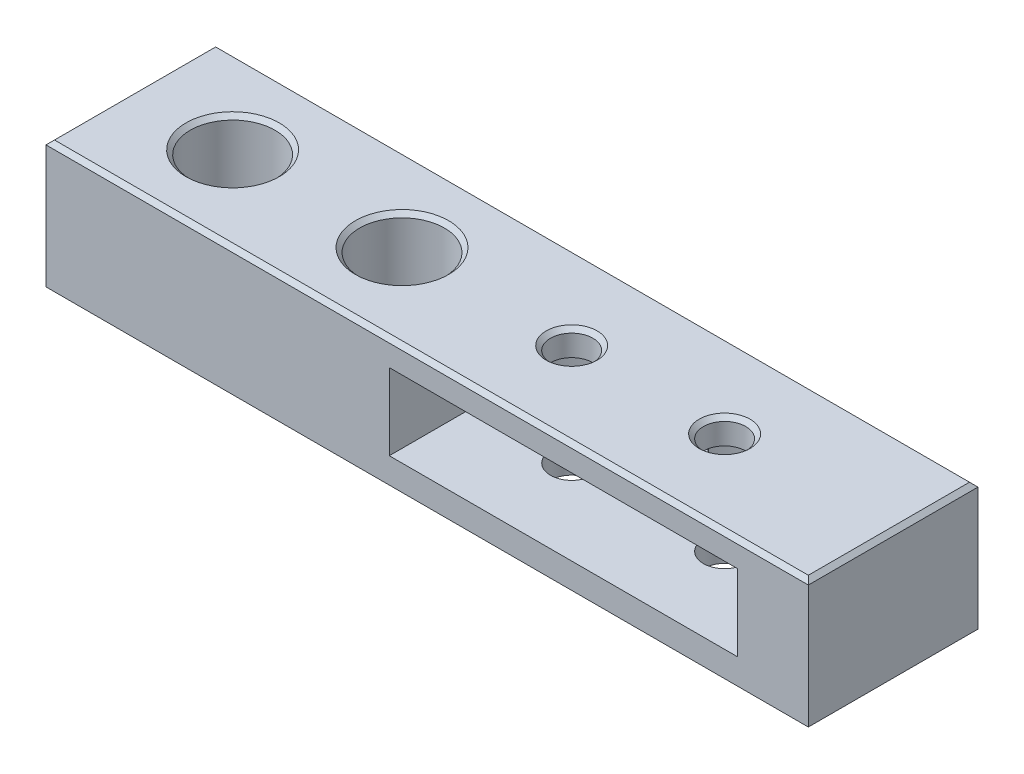
ISO-10303-21;
HEADER;
FILE_DESCRIPTION(('STEP AP214'),'2;1');
FILE_NAME('part.step','',(''),(''),'','','');
FILE_SCHEMA(('AUTOMOTIVE_DESIGN { 1 0 10303 214 1 1 1 1 }'));
ENDSEC;
DATA;
#1=APPLICATION_CONTEXT('core data for automotive mechanical design processes');
#2=APPLICATION_PROTOCOL_DEFINITION('international standard','automotive_design',2000,#1);
#3=PRODUCT_CONTEXT('',#1,'mechanical');
#4=PRODUCT('Part','Part','',(#3));
#5=PRODUCT_RELATED_PRODUCT_CATEGORY('part','',(#4));
#6=PRODUCT_DEFINITION_FORMATION('','',#4);
#7=PRODUCT_DEFINITION_CONTEXT('part definition',#1,'design');
#8=PRODUCT_DEFINITION('design','',#6,#7);
#9=PRODUCT_DEFINITION_SHAPE('','',#8);
#10=(LENGTH_UNIT() NAMED_UNIT(*) SI_UNIT(.MILLI.,.METRE.));
#11=(NAMED_UNIT(*) PLANE_ANGLE_UNIT() SI_UNIT($,.RADIAN.));
#12=(NAMED_UNIT(*) SI_UNIT($,.STERADIAN.) SOLID_ANGLE_UNIT());
#13=UNCERTAINTY_MEASURE_WITH_UNIT(LENGTH_MEASURE(1.E-05),#10,'distance_accuracy_value','');
#14=(GEOMETRIC_REPRESENTATION_CONTEXT(3) GLOBAL_UNCERTAINTY_ASSIGNED_CONTEXT((#13)) GLOBAL_UNIT_ASSIGNED_CONTEXT((#10,
#11,#12)) REPRESENTATION_CONTEXT('',''));
#15=CARTESIAN_POINT('',(0.,0.,0.));
#16=DIRECTION('',(0.,0.,1.));
#17=DIRECTION('',(1.,0.,0.));
#18=AXIS2_PLACEMENT_3D('',#15,#16,#17);
#19=CARTESIAN_POINT('',(0.,0.,0.));
#20=DIRECTION('',(0.,1.,0.));
#21=DIRECTION('',(0.,0.,1.));
#22=AXIS2_PLACEMENT_3D('',#19,#20,#21);
#23=PLANE('',#22);
#24=DIRECTION('',(0.,0.,-1.));
#25=VECTOR('',#24,1.);
#26=CARTESIAN_POINT('',(-14.,0.,-3.05));
#27=LINE('',#26,#25);
#28=CARTESIAN_POINT('',(-14.,0.,3.05));
#29=VERTEX_POINT('',#28);
#30=CARTESIAN_POINT('',(-14.,0.,-3.05));
#31=VERTEX_POINT('',#30);
#32=EDGE_CURVE('E217',#29,#31,#27,.T.);
#33=ORIENTED_EDGE('',*,*,#32,.F.);
#34=DIRECTION('',(-1.,0.,0.));
#35=VECTOR('',#34,1.);
#36=CARTESIAN_POINT('',(-9.,0.,3.05));
#37=LINE('',#36,#35);
#38=CARTESIAN_POINT('',(-9.,0.,3.05));
#39=VERTEX_POINT('',#38);
#40=EDGE_CURVE('E230',#39,#29,#37,.T.);
#41=ORIENTED_EDGE('',*,*,#40,.F.);
#42=DIRECTION('',(0.,0.,1.));
#43=VECTOR('',#42,1.);
#44=CARTESIAN_POINT('',(-9.,0.,-3.05));
#45=LINE('',#44,#43);
#46=CARTESIAN_POINT('',(-9.,0.,-3.05));
#47=VERTEX_POINT('',#46);
#48=EDGE_CURVE('E239',#47,#39,#45,.T.);
#49=ORIENTED_EDGE('',*,*,#48,.F.);
#50=DIRECTION('',(1.,0.,0.));
#51=VECTOR('',#50,1.);
#52=CARTESIAN_POINT('',(-9.,0.,-3.05));
#53=LINE('',#52,#51);
#54=EDGE_CURVE('E220',#31,#47,#53,.T.);
#55=ORIENTED_EDGE('',*,*,#54,.F.);
#56=EDGE_LOOP('',(#33,#41,#49,#55));
#57=FACE_BOUND('',#56,.T.);
#58=CARTESIAN_POINT('',(-58.,0.,0.));
#59=DIRECTION('',(0.,1.,0.));
#60=DIRECTION('',(0.,0.,1.));
#61=AXIS2_PLACEMENT_3D('',#58,#59,#60);
#62=CIRCLE('',#61,2.75);
#63=CARTESIAN_POINT('',(-58.,0.,2.75));
#64=VERTEX_POINT('',#63);
#65=EDGE_CURVE('E330',#64,#64,#62,.T.);
#66=ORIENTED_EDGE('',*,*,#65,.T.);
#67=EDGE_LOOP('',(#66));
#68=FACE_BOUND('',#67,.T.);
#69=CARTESIAN_POINT('',(-38.03,0.,0.));
#70=DIRECTION('',(0.,1.,0.));
#71=DIRECTION('',(0.,0.,1.));
#72=AXIS2_PLACEMENT_3D('',#69,#70,#71);
#73=CIRCLE('',#72,2.75);
#74=CARTESIAN_POINT('',(-38.03,0.,2.75));
#75=VERTEX_POINT('',#74);
#76=EDGE_CURVE('E339',#75,#75,#73,.T.);
#77=ORIENTED_EDGE('',*,*,#76,.T.);
#78=EDGE_LOOP('',(#77));
#79=FACE_BOUND('',#78,.T.);
#80=CARTESIAN_POINT('',(0.,0.,0.));
#81=DIRECTION('',(0.,1.,0.));
#82=DIRECTION('',(0.,0.,1.));
#83=AXIS2_PLACEMENT_3D('',#80,#81,#82);
#84=CIRCLE('',#83,2.5);
#85=CARTESIAN_POINT('',(0.,0.,2.5));
#86=VERTEX_POINT('',#85);
#87=EDGE_CURVE('E345',#86,#86,#84,.T.);
#88=ORIENTED_EDGE('',*,*,#87,.T.);
#89=EDGE_LOOP('',(#88));
#90=FACE_BOUND('',#89,.T.);
#91=CARTESIAN_POINT('',(-18.03,0.,0.));
#92=DIRECTION('',(0.,1.,0.));
#93=DIRECTION('',(0.,0.,1.));
#94=AXIS2_PLACEMENT_3D('',#91,#92,#93);
#95=CIRCLE('',#94,2.5);
#96=CARTESIAN_POINT('',(-18.03,0.,2.5));
#97=VERTEX_POINT('',#96);
#98=EDGE_CURVE('E342',#97,#97,#95,.T.);
#99=ORIENTED_EDGE('',*,*,#98,.T.);
#100=EDGE_LOOP('',(#99));
#101=FACE_BOUND('',#100,.T.);
#102=DIRECTION('',(1.,0.,0.));
#103=VECTOR('',#102,1.);
#104=CARTESIAN_POINT('',(-65.,0.,-3.05));
#105=LINE('',#104,#103);
#106=CARTESIAN_POINT('',(-70.,0.,-3.05));
#107=VERTEX_POINT('',#106);
#108=CARTESIAN_POINT('',(-65.,0.,-3.05));
#109=VERTEX_POINT('',#108);
#110=EDGE_CURVE('E422',#107,#109,#105,.T.);
#111=ORIENTED_EDGE('',*,*,#110,.F.);
#112=DIRECTION('',(0.,0.,1.));
#113=VECTOR('',#112,1.);
#114=CARTESIAN_POINT('',(-70.,0.,-9.99999999999999));
#115=LINE('',#114,#113);
#116=CARTESIAN_POINT('',(-70.,0.,-9.99999999999999));
#117=VERTEX_POINT('',#116);
#118=EDGE_CURVE('E216',#117,#107,#115,.T.);
#119=ORIENTED_EDGE('',*,*,#118,.F.);
#120=DIRECTION('',(-1.,0.,0.));
#121=VECTOR('',#120,1.);
#122=CARTESIAN_POINT('',(-70.,0.,-9.99999999999999));
#123=LINE('',#122,#121);
#124=CARTESIAN_POINT('',(19.87,0.,-10.));
#125=VERTEX_POINT('',#124);
#126=EDGE_CURVE('E348',#125,#117,#123,.T.);
#127=ORIENTED_EDGE('',*,*,#126,.F.);
#128=DIRECTION('',(0.,0.,-1.));
#129=VECTOR('',#128,1.);
#130=CARTESIAN_POINT('',(19.87,0.,10.));
#131=LINE('',#130,#129);
#132=CARTESIAN_POINT('',(19.87,0.,10.));
#133=VERTEX_POINT('',#132);
#134=EDGE_CURVE('E319',#133,#125,#131,.T.);
#135=ORIENTED_EDGE('',*,*,#134,.F.);
#136=DIRECTION('',(1.,0.,0.));
#137=VECTOR('',#136,1.);
#138=CARTESIAN_POINT('',(-70.,0.,10.));
#139=LINE('',#138,#137);
#140=CARTESIAN_POINT('',(-70.,0.,10.));
#141=VERTEX_POINT('',#140);
#142=EDGE_CURVE('E353',#141,#133,#139,.T.);
#143=ORIENTED_EDGE('',*,*,#142,.F.);
#144=CARTESIAN_POINT('',(-70.,0.,3.05));
#145=VERTEX_POINT('',#144);
#146=EDGE_CURVE('E351',#145,#141,#115,.T.);
#147=ORIENTED_EDGE('',*,*,#146,.F.);
#148=DIRECTION('',(-1.,0.,0.));
#149=VECTOR('',#148,1.);
#150=CARTESIAN_POINT('',(-65.,0.,3.05));
#151=LINE('',#150,#149);
#152=CARTESIAN_POINT('',(-65.,0.,3.05));
#153=VERTEX_POINT('',#152);
#154=EDGE_CURVE('E210',#153,#145,#151,.T.);
#155=ORIENTED_EDGE('',*,*,#154,.F.);
#156=DIRECTION('',(0.,0.,1.));
#157=VECTOR('',#156,1.);
#158=CARTESIAN_POINT('',(-65.,0.,-3.05));
#159=LINE('',#158,#157);
#160=EDGE_CURVE('E426',#109,#153,#159,.T.);
#161=ORIENTED_EDGE('',*,*,#160,.F.);
#162=EDGE_LOOP('',(#111,#119,#127,#135,#143,#147,#155,#161));
#163=FACE_BOUND('',#162,.T.);
#164=ADVANCED_FACE('F33',(#57,#68,#79,#90,#101,#163),#23,.F.);
#165=CARTESIAN_POINT('',(0.,15.,0.));
#166=DIRECTION('',(0.,-1.,0.));
#167=DIRECTION('',(0.,0.,-1.));
#168=AXIS2_PLACEMENT_3D('',#165,#166,#167);
#169=CYLINDRICAL_SURFACE('',#168,2.5);
#170=CARTESIAN_POINT('',(0.,14.5,0.));
#171=DIRECTION('',(0.,1.,0.));
#172=DIRECTION('',(0.,0.,1.));
#173=AXIS2_PLACEMENT_3D('',#170,#171,#172);
#174=CIRCLE('',#173,2.5);
#175=CARTESIAN_POINT('',(0.,14.5,2.5));
#176=VERTEX_POINT('',#175);
#177=EDGE_CURVE('E407',#176,#176,#174,.T.);
#178=ORIENTED_EDGE('',*,*,#177,.T.);
#179=EDGE_LOOP('',(#178));
#180=FACE_BOUND('',#179,.T.);
#181=CARTESIAN_POINT('',(0.,12.,0.));
#182=DIRECTION('',(0.,-1.,0.));
#183=DIRECTION('',(0.,0.,-1.));
#184=AXIS2_PLACEMENT_3D('',#181,#182,#183);
#185=CIRCLE('',#184,2.5);
#186=CARTESIAN_POINT('',(0.,12.,-2.5));
#187=VERTEX_POINT('',#186);
#188=EDGE_CURVE('E303',#187,#187,#185,.T.);
#189=ORIENTED_EDGE('',*,*,#188,.T.);
#190=EDGE_LOOP('',(#189));
#191=FACE_BOUND('',#190,.T.);
#192=ADVANCED_FACE('F472',(#180,#191),#169,.F.);
#193=CARTESIAN_POINT('',(-18.03,15.,0.));
#194=DIRECTION('',(0.,-1.,0.));
#195=DIRECTION('',(0.,0.,-1.));
#196=AXIS2_PLACEMENT_3D('',#193,#194,#195);
#197=CYLINDRICAL_SURFACE('',#196,2.5);
#198=CARTESIAN_POINT('',(-18.03,14.5,0.));
#199=DIRECTION('',(0.,1.,0.));
#200=DIRECTION('',(0.,0.,1.));
#201=AXIS2_PLACEMENT_3D('',#198,#199,#200);
#202=CIRCLE('',#201,2.5);
#203=CARTESIAN_POINT('',(-18.03,14.5,2.5));
#204=VERTEX_POINT('',#203);
#205=EDGE_CURVE('E376',#204,#204,#202,.T.);
#206=ORIENTED_EDGE('',*,*,#205,.T.);
#207=EDGE_LOOP('',(#206));
#208=FACE_BOUND('',#207,.T.);
#209=CARTESIAN_POINT('',(-18.03,12.,0.));
#210=DIRECTION('',(0.,-1.,0.));
#211=DIRECTION('',(0.,0.,-1.));
#212=AXIS2_PLACEMENT_3D('',#209,#210,#211);
#213=CIRCLE('',#212,2.5);
#214=CARTESIAN_POINT('',(-18.03,12.,-2.5));
#215=VERTEX_POINT('',#214);
#216=EDGE_CURVE('E291',#215,#215,#213,.T.);
#217=ORIENTED_EDGE('',*,*,#216,.T.);
#218=EDGE_LOOP('',(#217));
#219=FACE_BOUND('',#218,.T.);
#220=ADVANCED_FACE('F478',(#208,#219),#197,.F.);
#221=CARTESIAN_POINT('',(0.,15.,0.));
#222=DIRECTION('',(0.,1.,0.));
#223=DIRECTION('',(0.,0.,1.));
#224=AXIS2_PLACEMENT_3D('',#221,#222,#223);
#225=PLANE('',#224);
#226=CARTESIAN_POINT('',(-18.03,15.,0.));
#227=DIRECTION('',(0.,1.,0.));
#228=DIRECTION('',(0.,0.,1.));
#229=AXIS2_PLACEMENT_3D('',#226,#227,#228);
#230=CIRCLE('',#229,2.99999999999999);
#231=CARTESIAN_POINT('',(-18.03,15.,2.99999999999999));
#232=VERTEX_POINT('',#231);
#233=EDGE_CURVE('E397',#232,#232,#230,.F.);
#234=ORIENTED_EDGE('',*,*,#233,.T.);
#235=EDGE_LOOP('',(#234));
#236=FACE_BOUND('',#235,.T.);
#237=DIRECTION('',(-1.,0.,0.));
#238=VECTOR('',#237,1.);
#239=CARTESIAN_POINT('',(-70.,15.,-9.5));
#240=LINE('',#239,#238);
#241=CARTESIAN_POINT('',(19.37,15.,-9.50000000000001));
#242=VERTEX_POINT('',#241);
#243=CARTESIAN_POINT('',(-69.5,15.,-9.5));
#244=VERTEX_POINT('',#243);
#245=EDGE_CURVE('E392',#242,#244,#240,.T.);
#246=ORIENTED_EDGE('',*,*,#245,.T.);
#247=DIRECTION('',(0.,0.,1.));
#248=VECTOR('',#247,1.);
#249=CARTESIAN_POINT('',(-69.5,15.,10.));
#250=LINE('',#249,#248);
#251=CARTESIAN_POINT('',(-69.5,15.,9.50000000000003));
#252=VERTEX_POINT('',#251);
#253=EDGE_CURVE('E394',#244,#252,#250,.T.);
#254=ORIENTED_EDGE('',*,*,#253,.T.);
#255=DIRECTION('',(1.,0.,0.));
#256=VECTOR('',#255,1.);
#257=CARTESIAN_POINT('',(19.87,15.,9.50000000000001));
#258=LINE('',#257,#256);
#259=CARTESIAN_POINT('',(19.37,15.,9.50000000000001));
#260=VERTEX_POINT('',#259);
#261=EDGE_CURVE('E388',#252,#260,#258,.T.);
#262=ORIENTED_EDGE('',*,*,#261,.T.);
#263=DIRECTION('',(0.,0.,-1.));
#264=VECTOR('',#263,1.);
#265=CARTESIAN_POINT('',(19.37,15.,0.));
#266=LINE('',#265,#264);
#267=EDGE_CURVE('E390',#260,#242,#266,.T.);
#268=ORIENTED_EDGE('',*,*,#267,.T.);
#269=EDGE_LOOP('',(#246,#254,#262,#268));
#270=FACE_BOUND('',#269,.T.);
#271=CARTESIAN_POINT('',(0.,15.,0.));
#272=DIRECTION('',(0.,1.,0.));
#273=DIRECTION('',(0.,0.,1.));
#274=AXIS2_PLACEMENT_3D('',#271,#272,#273);
#275=CIRCLE('',#274,2.99999999999999);
#276=CARTESIAN_POINT('',(0.,15.,2.99999999999999));
#277=VERTEX_POINT('',#276);
#278=EDGE_CURVE('E385',#277,#277,#275,.F.);
#279=ORIENTED_EDGE('',*,*,#278,.T.);
#280=EDGE_LOOP('',(#279));
#281=FACE_BOUND('',#280,.T.);
#282=CARTESIAN_POINT('',(-38.03,15.,0.));
#283=DIRECTION('',(0.,1.,0.));
#284=DIRECTION('',(0.,0.,1.));
#285=AXIS2_PLACEMENT_3D('',#282,#283,#284);
#286=CIRCLE('',#285,5.49999999999998);
#287=CARTESIAN_POINT('',(-38.03,15.,5.49999999999998));
#288=VERTEX_POINT('',#287);
#289=EDGE_CURVE('E382',#288,#288,#286,.F.);
#290=ORIENTED_EDGE('',*,*,#289,.T.);
#291=EDGE_LOOP('',(#290));
#292=FACE_BOUND('',#291,.T.);
#293=CARTESIAN_POINT('',(-58.,15.,0.));
#294=DIRECTION('',(0.,1.,0.));
#295=DIRECTION('',(0.,0.,1.));
#296=AXIS2_PLACEMENT_3D('',#293,#294,#295);
#297=CIRCLE('',#296,5.49999999999998);
#298=CARTESIAN_POINT('',(-58.,15.,5.49999999999998));
#299=VERTEX_POINT('',#298);
#300=EDGE_CURVE('E379',#299,#299,#297,.F.);
#301=ORIENTED_EDGE('',*,*,#300,.T.);
#302=EDGE_LOOP('',(#301));
#303=FACE_BOUND('',#302,.T.);
#304=ADVANCED_FACE('F457',(#236,#270,#281,#292,#303),#225,.T.);
#305=CARTESIAN_POINT('',(-70.,15.,-9.99999999999999));
#306=DIRECTION('',(0.,0.,1.));
#307=DIRECTION('',(1.,0.,0.));
#308=AXIS2_PLACEMENT_3D('',#305,#306,#307);
#309=PLANE('',#308);
#310=DIRECTION('',(0.,1.,0.));
#311=VECTOR('',#310,1.);
#312=CARTESIAN_POINT('',(-23.7089083458003,3.,-9.99999999999999));
#313=LINE('',#312,#311);
#314=CARTESIAN_POINT('',(-23.7089083458003,12.,-9.99999999999999));
#315=VERTEX_POINT('',#314);
#316=CARTESIAN_POINT('',(-23.7089083458003,3.,-9.99999999999999));
#317=VERTEX_POINT('',#316);
#318=EDGE_CURVE('E370',#315,#317,#313,.F.);
#319=ORIENTED_EDGE('',*,*,#318,.T.);
#320=DIRECTION('',(1.,0.,0.));
#321=VECTOR('',#320,1.);
#322=CARTESIAN_POINT('',(-70.,3.,-9.99999999999999));
#323=LINE('',#322,#321);
#324=CARTESIAN_POINT('',(-12.3510916541997,3.,-9.99999999999999));
#325=VERTEX_POINT('',#324);
#326=EDGE_CURVE('E316',#317,#325,#323,.T.);
#327=ORIENTED_EDGE('',*,*,#326,.T.);
#328=DIRECTION('',(0.,1.,0.));
#329=VECTOR('',#328,1.);
#330=CARTESIAN_POINT('',(-12.3510916541997,3.,-9.99999999999999));
#331=LINE('',#330,#329);
#332=CARTESIAN_POINT('',(-12.3510916541997,12.,-9.99999999999999));
#333=VERTEX_POINT('',#332);
#334=EDGE_CURVE('E373',#325,#333,#331,.T.);
#335=ORIENTED_EDGE('',*,*,#334,.T.);
#336=DIRECTION('',(1.,0.,0.));
#337=VECTOR('',#336,1.);
#338=CARTESIAN_POINT('',(-70.,12.,-9.99999999999999));
#339=LINE('',#338,#337);
#340=EDGE_CURVE('E308',#315,#333,#339,.T.);
#341=ORIENTED_EDGE('',*,*,#340,.F.);
#342=EDGE_LOOP('',(#319,#327,#335,#341));
#343=FACE_BOUND('',#342,.T.);
#344=DIRECTION('',(0.,1.,0.));
#345=VECTOR('',#344,1.);
#346=CARTESIAN_POINT('',(-5.67890834580028,3.,-10.));
#347=LINE('',#346,#345);
#348=CARTESIAN_POINT('',(-5.67890834580028,12.,-10.));
#349=VERTEX_POINT('',#348);
#350=CARTESIAN_POINT('',(-5.67890834580028,3.,-10.));
#351=VERTEX_POINT('',#350);
#352=EDGE_CURVE('E360',#349,#351,#347,.F.);
#353=ORIENTED_EDGE('',*,*,#352,.T.);
#354=CARTESIAN_POINT('',(5.67890834580028,3.,-10.));
#355=VERTEX_POINT('',#354);
#356=EDGE_CURVE('E312',#351,#355,#323,.T.);
#357=ORIENTED_EDGE('',*,*,#356,.T.);
#358=DIRECTION('',(0.,1.,0.));
#359=VECTOR('',#358,1.);
#360=CARTESIAN_POINT('',(5.67890834580028,3.,-10.));
#361=LINE('',#360,#359);
#362=CARTESIAN_POINT('',(5.67890834580028,12.,-10.));
#363=VERTEX_POINT('',#362);
#364=EDGE_CURVE('E367',#355,#363,#361,.T.);
#365=ORIENTED_EDGE('',*,*,#364,.T.);
#366=EDGE_CURVE('E306',#349,#363,#339,.T.);
#367=ORIENTED_EDGE('',*,*,#366,.F.);
#368=EDGE_LOOP('',(#353,#357,#365,#367));
#369=FACE_BOUND('',#368,.T.);
#370=DIRECTION('',(0.,-1.,0.));
#371=VECTOR('',#370,1.);
#372=CARTESIAN_POINT('',(-70.,15.,-9.99999999999999));
#373=LINE('',#372,#371);
#374=CARTESIAN_POINT('',(-70.,14.5,-9.99999999999999));
#375=VERTEX_POINT('',#374);
#376=EDGE_CURVE('E358',#375,#117,#373,.T.);
#377=ORIENTED_EDGE('',*,*,#376,.F.);
#378=DIRECTION('',(1.,0.,0.));
#379=VECTOR('',#378,1.);
#380=CARTESIAN_POINT('',(19.87,14.5,-10.));
#381=LINE('',#380,#379);
#382=CARTESIAN_POINT('',(19.87,14.5,-10.));
#383=VERTEX_POINT('',#382);
#384=EDGE_CURVE('E58',#375,#383,#381,.T.);
#385=ORIENTED_EDGE('',*,*,#384,.T.);
#386=DIRECTION('',(0.,1.,0.));
#387=VECTOR('',#386,1.);
#388=CARTESIAN_POINT('',(19.87,0.,-10.));
#389=LINE('',#388,#387);
#390=EDGE_CURVE('E322',#125,#383,#389,.T.);
#391=ORIENTED_EDGE('',*,*,#390,.F.);
#392=ORIENTED_EDGE('',*,*,#126,.T.);
#393=EDGE_LOOP('',(#377,#385,#391,#392));
#394=FACE_BOUND('',#393,.T.);
#395=ADVANCED_FACE('F491',(#343,#369,#394),#309,.F.);
#396=CARTESIAN_POINT('',(-70.,15.,-9.99999999999999));
#397=DIRECTION('',(1.,0.,0.));
#398=DIRECTION('',(0.,0.,-1.));
#399=AXIS2_PLACEMENT_3D('',#396,#397,#398);
#400=PLANE('',#399);
#401=DIRECTION('',(0.,-1.,0.));
#402=VECTOR('',#401,1.);
#403=CARTESIAN_POINT('',(-70.,15.,10.));
#404=LINE('',#403,#402);
#405=CARTESIAN_POINT('',(-70.,14.5,10.));
#406=VERTEX_POINT('',#405);
#407=EDGE_CURVE('E356',#406,#141,#404,.T.);
#408=ORIENTED_EDGE('',*,*,#407,.F.);
#409=DIRECTION('',(0.,0.,-1.));
#410=VECTOR('',#409,1.);
#411=CARTESIAN_POINT('',(-70.,14.5,-9.99999999999999));
#412=LINE('',#411,#410);
#413=EDGE_CURVE('E400',#406,#375,#412,.T.);
#414=ORIENTED_EDGE('',*,*,#413,.T.);
#415=ORIENTED_EDGE('',*,*,#376,.T.);
#416=ORIENTED_EDGE('',*,*,#118,.T.);
#417=DIRECTION('',(0.,1.,0.));
#418=VECTOR('',#417,1.);
#419=CARTESIAN_POINT('',(-70.,-4.,-3.05));
#420=LINE('',#419,#418);
#421=CARTESIAN_POINT('',(-70.,-4.,-3.05));
#422=VERTEX_POINT('',#421);
#423=EDGE_CURVE('E195',#422,#107,#420,.T.);
#424=ORIENTED_EDGE('',*,*,#423,.F.);
#425=DIRECTION('',(0.,0.,-1.));
#426=VECTOR('',#425,1.);
#427=CARTESIAN_POINT('',(-70.,-4.,-3.05));
#428=LINE('',#427,#426);
#429=CARTESIAN_POINT('',(-70.,-4.,3.05));
#430=VERTEX_POINT('',#429);
#431=EDGE_CURVE('E202',#430,#422,#428,.T.);
#432=ORIENTED_EDGE('',*,*,#431,.F.);
#433=DIRECTION('',(0.,1.,0.));
#434=VECTOR('',#433,1.);
#435=CARTESIAN_POINT('',(-70.,-4.,3.05));
#436=LINE('',#435,#434);
#437=EDGE_CURVE('E434',#430,#145,#436,.T.);
#438=ORIENTED_EDGE('',*,*,#437,.T.);
#439=ORIENTED_EDGE('',*,*,#146,.T.);
#440=EDGE_LOOP('',(#408,#414,#415,#416,#424,#432,#438,#439));
#441=FACE_BOUND('',#440,.T.);
#442=ADVANCED_FACE('F214',(#441),#400,.F.);
#443=CARTESIAN_POINT('',(-70.,15.,10.));
#444=DIRECTION('',(0.,0.,-1.));
#445=DIRECTION('',(-1.,0.,0.));
#446=AXIS2_PLACEMENT_3D('',#443,#444,#445);
#447=PLANE('',#446);
#448=DIRECTION('',(0.,1.,0.));
#449=VECTOR('',#448,1.);
#450=CARTESIAN_POINT('',(11.5,3.,10.));
#451=LINE('',#450,#449);
#452=CARTESIAN_POINT('',(11.5,3.,10.));
#453=VERTEX_POINT('',#452);
#454=CARTESIAN_POINT('',(11.5,12.,10.));
#455=VERTEX_POINT('',#454);
#456=EDGE_CURVE('E292',#453,#455,#451,.T.);
#457=ORIENTED_EDGE('',*,*,#456,.F.);
#458=DIRECTION('',(1.,0.,0.));
#459=VECTOR('',#458,1.);
#460=CARTESIAN_POINT('',(11.5,3.,10.));
#461=LINE('',#460,#459);
#462=CARTESIAN_POINT('',(-29.53,3.,10.));
#463=VERTEX_POINT('',#462);
#464=EDGE_CURVE('E267',#463,#453,#461,.T.);
#465=ORIENTED_EDGE('',*,*,#464,.F.);
#466=DIRECTION('',(0.,1.,0.));
#467=VECTOR('',#466,1.);
#468=CARTESIAN_POINT('',(-29.53,3.,10.));
#469=LINE('',#468,#467);
#470=CARTESIAN_POINT('',(-29.53,12.,10.));
#471=VERTEX_POINT('',#470);
#472=EDGE_CURVE('E295',#463,#471,#469,.T.);
#473=ORIENTED_EDGE('',*,*,#472,.T.);
#474=DIRECTION('',(1.,0.,0.));
#475=VECTOR('',#474,1.);
#476=CARTESIAN_POINT('',(11.5,12.,10.));
#477=LINE('',#476,#475);
#478=EDGE_CURVE('E283',#471,#455,#477,.T.);
#479=ORIENTED_EDGE('',*,*,#478,.T.);
#480=EDGE_LOOP('',(#457,#465,#473,#479));
#481=FACE_BOUND('',#480,.T.);
#482=DIRECTION('',(0.,-1.,0.));
#483=VECTOR('',#482,1.);
#484=CARTESIAN_POINT('',(19.87,15.,10.));
#485=LINE('',#484,#483);
#486=CARTESIAN_POINT('',(19.87,14.5,10.));
#487=VERTEX_POINT('',#486);
#488=EDGE_CURVE('E317',#487,#133,#485,.T.);
#489=ORIENTED_EDGE('',*,*,#488,.F.);
#490=DIRECTION('',(-1.,0.,0.));
#491=VECTOR('',#490,1.);
#492=CARTESIAN_POINT('',(-70.,14.5,10.));
#493=LINE('',#492,#491);
#494=EDGE_CURVE('E405',#487,#406,#493,.T.);
#495=ORIENTED_EDGE('',*,*,#494,.T.);
#496=ORIENTED_EDGE('',*,*,#407,.T.);
#497=ORIENTED_EDGE('',*,*,#142,.T.);
#498=EDGE_LOOP('',(#489,#495,#496,#497));
#499=FACE_BOUND('',#498,.T.);
#500=ADVANCED_FACE('F485',(#481,#499),#447,.F.);
#501=CARTESIAN_POINT('',(0.,3.,0.));
#502=DIRECTION('',(0.,-1.,0.));
#503=DIRECTION('',(0.,0.,-1.));
#504=AXIS2_PLACEMENT_3D('',#501,#502,#503);
#505=CIRCLE('',#504,2.5);
#506=CARTESIAN_POINT('',(0.,3.,-2.5));
#507=VERTEX_POINT('',#506);
#508=EDGE_CURVE('E309',#507,#507,#505,.T.);
#509=ORIENTED_EDGE('',*,*,#508,.F.);
#510=EDGE_LOOP('',(#509));
#511=FACE_BOUND('',#510,.T.);
#512=ORIENTED_EDGE('',*,*,#87,.F.);
#513=EDGE_LOOP('',(#512));
#514=FACE_BOUND('',#513,.T.);
#515=ADVANCED_FACE('F481',(#511,#514),#169,.F.);
#516=CARTESIAN_POINT('',(-18.03,3.,0.));
#517=DIRECTION('',(0.,-1.,0.));
#518=DIRECTION('',(0.,0.,-1.));
#519=AXIS2_PLACEMENT_3D('',#516,#517,#518);
#520=CIRCLE('',#519,2.5);
#521=CARTESIAN_POINT('',(-18.03,3.,-2.5));
#522=VERTEX_POINT('',#521);
#523=EDGE_CURVE('E313',#522,#522,#520,.T.);
#524=ORIENTED_EDGE('',*,*,#523,.F.);
#525=EDGE_LOOP('',(#524));
#526=FACE_BOUND('',#525,.T.);
#527=ORIENTED_EDGE('',*,*,#98,.F.);
#528=EDGE_LOOP('',(#527));
#529=FACE_BOUND('',#528,.T.);
#530=ADVANCED_FACE('F589',(#526,#529),#197,.F.);
#531=CARTESIAN_POINT('',(-38.03,15.,0.));
#532=DIRECTION('',(0.,1.,0.));
#533=DIRECTION('',(0.,0.,1.));
#534=AXIS2_PLACEMENT_3D('',#531,#532,#533);
#535=CYLINDRICAL_SURFACE('',#534,2.75);
#536=ORIENTED_EDGE('',*,*,#76,.F.);
#537=EDGE_LOOP('',(#536));
#538=FACE_BOUND('',#537,.T.);
#539=CARTESIAN_POINT('',(-38.03,5.,0.));
#540=DIRECTION('',(0.,1.,0.));
#541=DIRECTION('',(0.,0.,1.));
#542=AXIS2_PLACEMENT_3D('',#539,#540,#541);
#543=CIRCLE('',#542,2.75);
#544=CARTESIAN_POINT('',(-38.03,5.,2.75));
#545=VERTEX_POINT('',#544);
#546=EDGE_CURVE('E336',#545,#545,#543,.T.);
#547=ORIENTED_EDGE('',*,*,#546,.T.);
#548=EDGE_LOOP('',(#547));
#549=FACE_BOUND('',#548,.T.);
#550=ADVANCED_FACE('F585',(#538,#549),#535,.F.);
#551=CARTESIAN_POINT('',(-35.28,5.,0.));
#552=DIRECTION('',(0.,-1.,0.));
#553=DIRECTION('',(0.,0.,-1.));
#554=AXIS2_PLACEMENT_3D('',#551,#552,#553);
#555=PLANE('',#554);
#556=ORIENTED_EDGE('',*,*,#546,.F.);
#557=EDGE_LOOP('',(#556));
#558=FACE_BOUND('',#557,.T.);
#559=CARTESIAN_POINT('',(-38.03,5.,0.));
#560=DIRECTION('',(0.,1.,0.));
#561=DIRECTION('',(0.,0.,1.));
#562=AXIS2_PLACEMENT_3D('',#559,#560,#561);
#563=CIRCLE('',#562,5.);
#564=CARTESIAN_POINT('',(-38.03,5.,5.));
#565=VERTEX_POINT('',#564);
#566=EDGE_CURVE('E333',#565,#565,#563,.T.);
#567=ORIENTED_EDGE('',*,*,#566,.T.);
#568=EDGE_LOOP('',(#567));
#569=FACE_BOUND('',#568,.T.);
#570=ADVANCED_FACE('F581',(#558,#569),#555,.F.);
#571=CARTESIAN_POINT('',(-38.03,15.,0.));
#572=DIRECTION('',(0.,1.,0.));
#573=DIRECTION('',(0.,0.,1.));
#574=AXIS2_PLACEMENT_3D('',#571,#572,#573);
#575=CYLINDRICAL_SURFACE('',#574,5.);
#576=CARTESIAN_POINT('',(-38.03,14.5,0.));
#577=DIRECTION('',(0.,1.,0.));
#578=DIRECTION('',(0.,0.,1.));
#579=AXIS2_PLACEMENT_3D('',#576,#577,#578);
#580=CIRCLE('',#579,5.);
#581=CARTESIAN_POINT('',(-38.03,14.5,5.));
#582=VERTEX_POINT('',#581);
#583=EDGE_CURVE('E42',#582,#582,#580,.T.);
#584=ORIENTED_EDGE('',*,*,#583,.T.);
#585=EDGE_LOOP('',(#584));
#586=FACE_BOUND('',#585,.T.);
#587=ORIENTED_EDGE('',*,*,#566,.F.);
#588=EDGE_LOOP('',(#587));
#589=FACE_BOUND('',#588,.T.);
#590=ADVANCED_FACE('F577',(#586,#589),#575,.F.);
#591=CARTESIAN_POINT('',(-58.,15.,0.));
#592=DIRECTION('',(0.,1.,0.));
#593=DIRECTION('',(0.,0.,1.));
#594=AXIS2_PLACEMENT_3D('',#591,#592,#593);
#595=CYLINDRICAL_SURFACE('',#594,2.75);
#596=ORIENTED_EDGE('',*,*,#65,.F.);
#597=EDGE_LOOP('',(#596));
#598=FACE_BOUND('',#597,.T.);
#599=CARTESIAN_POINT('',(-58.,5.,0.));
#600=DIRECTION('',(0.,1.,0.));
#601=DIRECTION('',(0.,0.,1.));
#602=AXIS2_PLACEMENT_3D('',#599,#600,#601);
#603=CIRCLE('',#602,2.75);
#604=CARTESIAN_POINT('',(-58.,5.,2.75));
#605=VERTEX_POINT('',#604);
#606=EDGE_CURVE('E327',#605,#605,#603,.T.);
#607=ORIENTED_EDGE('',*,*,#606,.T.);
#608=EDGE_LOOP('',(#607));
#609=FACE_BOUND('',#608,.T.);
#610=ADVANCED_FACE('F573',(#598,#609),#595,.F.);
#611=CARTESIAN_POINT('',(-55.25,5.,0.));
#612=DIRECTION('',(0.,-1.,0.));
#613=DIRECTION('',(0.,0.,-1.));
#614=AXIS2_PLACEMENT_3D('',#611,#612,#613);
#615=PLANE('',#614);
#616=ORIENTED_EDGE('',*,*,#606,.F.);
#617=EDGE_LOOP('',(#616));
#618=FACE_BOUND('',#617,.T.);
#619=CARTESIAN_POINT('',(-58.,5.,0.));
#620=DIRECTION('',(0.,1.,0.));
#621=DIRECTION('',(0.,0.,1.));
#622=AXIS2_PLACEMENT_3D('',#619,#620,#621);
#623=CIRCLE('',#622,5.);
#624=CARTESIAN_POINT('',(-58.,5.,5.));
#625=VERTEX_POINT('',#624);
#626=EDGE_CURVE('E324',#625,#625,#623,.T.);
#627=ORIENTED_EDGE('',*,*,#626,.T.);
#628=EDGE_LOOP('',(#627));
#629=FACE_BOUND('',#628,.T.);
#630=ADVANCED_FACE('F569',(#618,#629),#615,.F.);
#631=CARTESIAN_POINT('',(-58.,15.,0.));
#632=DIRECTION('',(0.,1.,0.));
#633=DIRECTION('',(0.,0.,1.));
#634=AXIS2_PLACEMENT_3D('',#631,#632,#633);
#635=CYLINDRICAL_SURFACE('',#634,4.99999999999999);
#636=CARTESIAN_POINT('',(-58.,14.5,0.));
#637=DIRECTION('',(0.,1.,0.));
#638=DIRECTION('',(0.,0.,1.));
#639=AXIS2_PLACEMENT_3D('',#636,#637,#638);
#640=CIRCLE('',#639,4.99999999999999);
#641=CARTESIAN_POINT('',(-58.,14.5,5.));
#642=VERTEX_POINT('',#641);
#643=EDGE_CURVE('E11',#642,#642,#640,.T.);
#644=ORIENTED_EDGE('',*,*,#643,.T.);
#645=EDGE_LOOP('',(#644));
#646=FACE_BOUND('',#645,.T.);
#647=ORIENTED_EDGE('',*,*,#626,.F.);
#648=EDGE_LOOP('',(#647));
#649=FACE_BOUND('',#648,.T.);
#650=ADVANCED_FACE('F562',(#646,#649),#635,.F.);
#651=CARTESIAN_POINT('',(19.87,0.,0.));
#652=DIRECTION('',(1.,0.,0.));
#653=DIRECTION('',(0.,0.,-1.));
#654=AXIS2_PLACEMENT_3D('',#651,#652,#653);
#655=PLANE('',#654);
#656=ORIENTED_EDGE('',*,*,#390,.T.);
#657=DIRECTION('',(0.,0.,1.));
#658=VECTOR('',#657,1.);
#659=CARTESIAN_POINT('',(19.87,14.5,0.));
#660=LINE('',#659,#658);
#661=EDGE_CURVE('E50',#383,#487,#660,.T.);
#662=ORIENTED_EDGE('',*,*,#661,.T.);
#663=ORIENTED_EDGE('',*,*,#488,.T.);
#664=ORIENTED_EDGE('',*,*,#134,.T.);
#665=EDGE_LOOP('',(#656,#662,#663,#664));
#666=FACE_BOUND('',#665,.T.);
#667=ADVANCED_FACE('F556',(#666),#655,.T.);
#668=CARTESIAN_POINT('',(0.,3.,0.));
#669=DIRECTION('',(0.,1.,0.));
#670=DIRECTION('',(0.,0.,1.));
#671=AXIS2_PLACEMENT_3D('',#668,#669,#670);
#672=CYLINDRICAL_SURFACE('',#671,11.5);
#673=CARTESIAN_POINT('',(0.,3.,0.));
#674=DIRECTION('',(0.,1.,0.));
#675=DIRECTION('',(0.,0.,-1.));
#676=AXIS2_PLACEMENT_3D('',#673,#674,#675);
#677=CIRCLE('',#676,11.5);
#678=CARTESIAN_POINT('',(11.5,3.,0.));
#679=VERTEX_POINT('',#678);
#680=EDGE_CURVE('E256',#679,#355,#677,.T.);
#681=ORIENTED_EDGE('',*,*,#680,.F.);
#682=DIRECTION('',(0.,1.,0.));
#683=VECTOR('',#682,1.);
#684=CARTESIAN_POINT('',(11.5,3.,0.));
#685=LINE('',#684,#683);
#686=CARTESIAN_POINT('',(11.5,12.,0.));
#687=VERTEX_POINT('',#686);
#688=EDGE_CURVE('E289',#679,#687,#685,.T.);
#689=ORIENTED_EDGE('',*,*,#688,.T.);
#690=CARTESIAN_POINT('',(0.,12.,0.));
#691=DIRECTION('',(0.,1.,0.));
#692=DIRECTION('',(0.,0.,-1.));
#693=AXIS2_PLACEMENT_3D('',#690,#691,#692);
#694=CIRCLE('',#693,11.5);
#695=EDGE_CURVE('E273',#687,#363,#694,.T.);
#696=ORIENTED_EDGE('',*,*,#695,.T.);
#697=ORIENTED_EDGE('',*,*,#364,.F.);
#698=EDGE_LOOP('',(#681,#689,#696,#697));
#699=FACE_BOUND('',#698,.T.);
#700=ADVANCED_FACE('F554',(#699),#672,.F.);
#701=CARTESIAN_POINT('',(-9.015,12.,-7.14001225489144));
#702=VERTEX_POINT('',#701);
#703=EDGE_CURVE('E255',#349,#702,#694,.T.);
#704=ORIENTED_EDGE('',*,*,#703,.T.);
#705=DIRECTION('',(0.,1.,0.));
#706=VECTOR('',#705,1.);
#707=CARTESIAN_POINT('',(-9.015,3.,-7.14001225489144));
#708=LINE('',#707,#706);
#709=CARTESIAN_POINT('',(-9.015,3.,-7.14001225489144));
#710=VERTEX_POINT('',#709);
#711=EDGE_CURVE('E272',#710,#702,#708,.T.);
#712=ORIENTED_EDGE('',*,*,#711,.F.);
#713=EDGE_CURVE('E260',#351,#710,#677,.T.);
#714=ORIENTED_EDGE('',*,*,#713,.F.);
#715=ORIENTED_EDGE('',*,*,#352,.F.);
#716=EDGE_LOOP('',(#704,#712,#714,#715));
#717=FACE_BOUND('',#716,.T.);
#718=ADVANCED_FACE('F552',(#717),#672,.F.);
#719=CARTESIAN_POINT('',(-18.03,3.,0.));
#720=DIRECTION('',(0.,1.,0.));
#721=DIRECTION('',(0.,0.,1.));
#722=AXIS2_PLACEMENT_3D('',#719,#720,#721);
#723=CYLINDRICAL_SURFACE('',#722,11.5);
#724=CARTESIAN_POINT('',(-18.03,3.,0.));
#725=DIRECTION('',(0.,1.,0.));
#726=DIRECTION('',(0.,0.,1.));
#727=AXIS2_PLACEMENT_3D('',#724,#725,#726);
#728=CIRCLE('',#727,11.5);
#729=EDGE_CURVE('E261',#710,#325,#728,.T.);
#730=ORIENTED_EDGE('',*,*,#729,.F.);
#731=ORIENTED_EDGE('',*,*,#711,.T.);
#732=CARTESIAN_POINT('',(-18.03,12.,0.));
#733=DIRECTION('',(0.,1.,0.));
#734=DIRECTION('',(0.,0.,1.));
#735=AXIS2_PLACEMENT_3D('',#732,#733,#734);
#736=CIRCLE('',#735,11.5);
#737=EDGE_CURVE('E277',#702,#333,#736,.T.);
#738=ORIENTED_EDGE('',*,*,#737,.T.);
#739=ORIENTED_EDGE('',*,*,#334,.F.);
#740=EDGE_LOOP('',(#730,#731,#738,#739));
#741=FACE_BOUND('',#740,.T.);
#742=ADVANCED_FACE('F530',(#741),#723,.F.);
#743=CARTESIAN_POINT('',(-29.53,12.,0.));
#744=VERTEX_POINT('',#743);
#745=EDGE_CURVE('E276',#315,#744,#736,.T.);
#746=ORIENTED_EDGE('',*,*,#745,.T.);
#747=DIRECTION('',(0.,1.,0.));
#748=VECTOR('',#747,1.);
#749=CARTESIAN_POINT('',(-29.53,3.,0.));
#750=LINE('',#749,#748);
#751=CARTESIAN_POINT('',(-29.53,3.,0.));
#752=VERTEX_POINT('',#751);
#753=EDGE_CURVE('E298',#752,#744,#750,.T.);
#754=ORIENTED_EDGE('',*,*,#753,.F.);
#755=EDGE_CURVE('E259',#317,#752,#728,.T.);
#756=ORIENTED_EDGE('',*,*,#755,.F.);
#757=ORIENTED_EDGE('',*,*,#318,.F.);
#758=EDGE_LOOP('',(#746,#754,#756,#757));
#759=FACE_BOUND('',#758,.T.);
#760=ADVANCED_FACE('F538',(#759),#723,.F.);
#761=CARTESIAN_POINT('',(0.,3.,0.));
#762=DIRECTION('',(0.,-1.,0.));
#763=DIRECTION('',(0.,0.,-1.));
#764=AXIS2_PLACEMENT_3D('',#761,#762,#763);
#765=PLANE('',#764);
#766=ORIENTED_EDGE('',*,*,#508,.T.);
#767=EDGE_LOOP('',(#766));
#768=FACE_BOUND('',#767,.T.);
#769=ORIENTED_EDGE('',*,*,#523,.T.);
#770=EDGE_LOOP('',(#769));
#771=FACE_BOUND('',#770,.T.);
#772=ORIENTED_EDGE('',*,*,#755,.T.);
#773=DIRECTION('',(0.,0.,1.));
#774=VECTOR('',#773,1.);
#775=CARTESIAN_POINT('',(-29.53,3.,0.));
#776=LINE('',#775,#774);
#777=EDGE_CURVE('E264',#752,#463,#776,.T.);
#778=ORIENTED_EDGE('',*,*,#777,.T.);
#779=ORIENTED_EDGE('',*,*,#464,.T.);
#780=DIRECTION('',(0.,0.,-1.));
#781=VECTOR('',#780,1.);
#782=CARTESIAN_POINT('',(11.5,3.,0.));
#783=LINE('',#782,#781);
#784=EDGE_CURVE('E269',#453,#679,#783,.T.);
#785=ORIENTED_EDGE('',*,*,#784,.T.);
#786=ORIENTED_EDGE('',*,*,#680,.T.);
#787=ORIENTED_EDGE('',*,*,#356,.F.);
#788=ORIENTED_EDGE('',*,*,#713,.T.);
#789=ORIENTED_EDGE('',*,*,#729,.T.);
#790=ORIENTED_EDGE('',*,*,#326,.F.);
#791=EDGE_LOOP('',(#772,#778,#779,#785,#786,#787,#788,#789,#790));
#792=FACE_BOUND('',#791,.T.);
#793=ADVANCED_FACE('F520',(#768,#771,#792),#765,.F.);
#794=CARTESIAN_POINT('',(0.,12.,0.));
#795=DIRECTION('',(0.,-1.,0.));
#796=DIRECTION('',(0.,0.,-1.));
#797=AXIS2_PLACEMENT_3D('',#794,#795,#796);
#798=PLANE('',#797);
#799=ORIENTED_EDGE('',*,*,#188,.F.);
#800=EDGE_LOOP('',(#799));
#801=FACE_BOUND('',#800,.T.);
#802=ORIENTED_EDGE('',*,*,#216,.F.);
#803=EDGE_LOOP('',(#802));
#804=FACE_BOUND('',#803,.T.);
#805=ORIENTED_EDGE('',*,*,#340,.T.);
#806=ORIENTED_EDGE('',*,*,#737,.F.);
#807=ORIENTED_EDGE('',*,*,#703,.F.);
#808=ORIENTED_EDGE('',*,*,#366,.T.);
#809=ORIENTED_EDGE('',*,*,#695,.F.);
#810=DIRECTION('',(0.,0.,-1.));
#811=VECTOR('',#810,1.);
#812=CARTESIAN_POINT('',(11.5,12.,0.));
#813=LINE('',#812,#811);
#814=EDGE_CURVE('E286',#455,#687,#813,.T.);
#815=ORIENTED_EDGE('',*,*,#814,.F.);
#816=ORIENTED_EDGE('',*,*,#478,.F.);
#817=DIRECTION('',(0.,0.,1.));
#818=VECTOR('',#817,1.);
#819=CARTESIAN_POINT('',(-29.53,12.,0.));
#820=LINE('',#819,#818);
#821=EDGE_CURVE('E280',#744,#471,#820,.T.);
#822=ORIENTED_EDGE('',*,*,#821,.F.);
#823=ORIENTED_EDGE('',*,*,#745,.F.);
#824=EDGE_LOOP('',(#805,#806,#807,#808,#809,#815,#816,#822,#823));
#825=FACE_BOUND('',#824,.T.);
#826=ADVANCED_FACE('F516',(#801,#804,#825),#798,.T.);
#827=CARTESIAN_POINT('',(11.5,3.,0.));
#828=DIRECTION('',(1.,0.,0.));
#829=DIRECTION('',(0.,0.,-1.));
#830=AXIS2_PLACEMENT_3D('',#827,#828,#829);
#831=PLANE('',#830);
#832=ORIENTED_EDGE('',*,*,#814,.T.);
#833=ORIENTED_EDGE('',*,*,#688,.F.);
#834=ORIENTED_EDGE('',*,*,#784,.F.);
#835=ORIENTED_EDGE('',*,*,#456,.T.);
#836=EDGE_LOOP('',(#832,#833,#834,#835));
#837=FACE_BOUND('',#836,.T.);
#838=ADVANCED_FACE('F519',(#837),#831,.F.);
#839=CARTESIAN_POINT('',(-29.53,3.,0.));
#840=DIRECTION('',(-1.,0.,0.));
#841=DIRECTION('',(0.,0.,1.));
#842=AXIS2_PLACEMENT_3D('',#839,#840,#841);
#843=PLANE('',#842);
#844=ORIENTED_EDGE('',*,*,#821,.T.);
#845=ORIENTED_EDGE('',*,*,#472,.F.);
#846=ORIENTED_EDGE('',*,*,#777,.F.);
#847=ORIENTED_EDGE('',*,*,#753,.T.);
#848=EDGE_LOOP('',(#844,#845,#846,#847));
#849=FACE_BOUND('',#848,.T.);
#850=ADVANCED_FACE('F541',(#849),#843,.F.);
#851=CARTESIAN_POINT('',(-14.,-4.,-3.05));
#852=DIRECTION('',(1.,0.,0.));
#853=DIRECTION('',(0.,0.,-1.));
#854=AXIS2_PLACEMENT_3D('',#851,#852,#853);
#855=PLANE('',#854);
#856=ORIENTED_EDGE('',*,*,#32,.T.);
#857=DIRECTION('',(0.,1.,0.));
#858=VECTOR('',#857,1.);
#859=CARTESIAN_POINT('',(-14.,-4.,-3.05));
#860=LINE('',#859,#858);
#861=CARTESIAN_POINT('',(-14.,-4.,-3.05));
#862=VERTEX_POINT('',#861);
#863=EDGE_CURVE('E252',#862,#31,#860,.T.);
#864=ORIENTED_EDGE('',*,*,#863,.F.);
#865=DIRECTION('',(0.,0.,-1.));
#866=VECTOR('',#865,1.);
#867=CARTESIAN_POINT('',(-14.,-4.,-3.05));
#868=LINE('',#867,#866);
#869=CARTESIAN_POINT('',(-14.,-4.,3.05));
#870=VERTEX_POINT('',#869);
#871=EDGE_CURVE('E226',#870,#862,#868,.T.);
#872=ORIENTED_EDGE('',*,*,#871,.F.);
#873=DIRECTION('',(0.,1.,0.));
#874=VECTOR('',#873,1.);
#875=CARTESIAN_POINT('',(-14.,-4.,3.05));
#876=LINE('',#875,#874);
#877=EDGE_CURVE('E235',#870,#29,#876,.T.);
#878=ORIENTED_EDGE('',*,*,#877,.T.);
#879=EDGE_LOOP('',(#856,#864,#872,#878));
#880=FACE_BOUND('',#879,.T.);
#881=ADVANCED_FACE('F613',(#880),#855,.F.);
#882=CARTESIAN_POINT('',(-9.,-4.,-3.05));
#883=DIRECTION('',(0.,0.,1.));
#884=DIRECTION('',(1.,0.,0.));
#885=AXIS2_PLACEMENT_3D('',#882,#883,#884);
#886=PLANE('',#885);
#887=ORIENTED_EDGE('',*,*,#54,.T.);
#888=DIRECTION('',(0.,1.,0.));
#889=VECTOR('',#888,1.);
#890=CARTESIAN_POINT('',(-9.,-4.,-3.05));
#891=LINE('',#890,#889);
#892=CARTESIAN_POINT('',(-9.,-4.,-3.05));
#893=VERTEX_POINT('',#892);
#894=EDGE_CURVE('E249',#893,#47,#891,.T.);
#895=ORIENTED_EDGE('',*,*,#894,.F.);
#896=DIRECTION('',(1.,0.,0.));
#897=VECTOR('',#896,1.);
#898=CARTESIAN_POINT('',(-9.,-4.,-3.05));
#899=LINE('',#898,#897);
#900=EDGE_CURVE('E229',#862,#893,#899,.T.);
#901=ORIENTED_EDGE('',*,*,#900,.F.);
#902=ORIENTED_EDGE('',*,*,#863,.T.);
#903=EDGE_LOOP('',(#887,#895,#901,#902));
#904=FACE_BOUND('',#903,.T.);
#905=ADVANCED_FACE('F621',(#904),#886,.F.);
#906=CARTESIAN_POINT('',(-9.,-4.,-3.05));
#907=DIRECTION('',(-1.,0.,0.));
#908=DIRECTION('',(0.,0.,1.));
#909=AXIS2_PLACEMENT_3D('',#906,#907,#908);
#910=PLANE('',#909);
#911=ORIENTED_EDGE('',*,*,#48,.T.);
#912=DIRECTION('',(0.,1.,0.));
#913=VECTOR('',#912,1.);
#914=CARTESIAN_POINT('',(-9.,-4.,3.05));
#915=LINE('',#914,#913);
#916=CARTESIAN_POINT('',(-9.,-4.,3.05));
#917=VERTEX_POINT('',#916);
#918=EDGE_CURVE('E246',#917,#39,#915,.T.);
#919=ORIENTED_EDGE('',*,*,#918,.F.);
#920=DIRECTION('',(0.,0.,1.));
#921=VECTOR('',#920,1.);
#922=CARTESIAN_POINT('',(-9.,-4.,-3.05));
#923=LINE('',#922,#921);
#924=EDGE_CURVE('E232',#893,#917,#923,.T.);
#925=ORIENTED_EDGE('',*,*,#924,.F.);
#926=ORIENTED_EDGE('',*,*,#894,.T.);
#927=EDGE_LOOP('',(#911,#919,#925,#926));
#928=FACE_BOUND('',#927,.T.);
#929=ADVANCED_FACE('F626',(#928),#910,.F.);
#930=CARTESIAN_POINT('',(-9.,-4.,3.05));
#931=DIRECTION('',(0.,0.,-1.));
#932=DIRECTION('',(-1.,0.,0.));
#933=AXIS2_PLACEMENT_3D('',#930,#931,#932);
#934=PLANE('',#933);
#935=ORIENTED_EDGE('',*,*,#40,.T.);
#936=ORIENTED_EDGE('',*,*,#877,.F.);
#937=DIRECTION('',(-1.,0.,0.));
#938=VECTOR('',#937,1.);
#939=CARTESIAN_POINT('',(-9.,-4.,3.05));
#940=LINE('',#939,#938);
#941=EDGE_CURVE('E234',#917,#870,#940,.T.);
#942=ORIENTED_EDGE('',*,*,#941,.F.);
#943=ORIENTED_EDGE('',*,*,#918,.T.);
#944=EDGE_LOOP('',(#935,#936,#942,#943));
#945=FACE_BOUND('',#944,.T.);
#946=ADVANCED_FACE('F632',(#945),#934,.F.);
#947=CARTESIAN_POINT('',(0.,-4.,0.));
#948=DIRECTION('',(0.,-1.,0.));
#949=DIRECTION('',(0.,0.,-1.));
#950=AXIS2_PLACEMENT_3D('',#947,#948,#949);
#951=PLANE('',#950);
#952=ORIENTED_EDGE('',*,*,#871,.T.);
#953=ORIENTED_EDGE('',*,*,#900,.T.);
#954=ORIENTED_EDGE('',*,*,#924,.T.);
#955=ORIENTED_EDGE('',*,*,#941,.T.);
#956=EDGE_LOOP('',(#952,#953,#954,#955));
#957=FACE_BOUND('',#956,.T.);
#958=ADVANCED_FACE('F639',(#957),#951,.T.);
#959=CARTESIAN_POINT('',(-65.,-4.,-3.05));
#960=DIRECTION('',(0.,0.,1.));
#961=DIRECTION('',(1.,0.,0.));
#962=AXIS2_PLACEMENT_3D('',#959,#960,#961);
#963=PLANE('',#962);
#964=ORIENTED_EDGE('',*,*,#110,.T.);
#965=DIRECTION('',(0.,1.,0.));
#966=VECTOR('',#965,1.);
#967=CARTESIAN_POINT('',(-65.,-4.,-3.05));
#968=LINE('',#967,#966);
#969=CARTESIAN_POINT('',(-65.,-4.,-3.05));
#970=VERTEX_POINT('',#969);
#971=EDGE_CURVE('E198',#970,#109,#968,.T.);
#972=ORIENTED_EDGE('',*,*,#971,.F.);
#973=DIRECTION('',(1.,0.,0.));
#974=VECTOR('',#973,1.);
#975=CARTESIAN_POINT('',(-65.,-4.,-3.05));
#976=LINE('',#975,#974);
#977=EDGE_CURVE('E191',#422,#970,#976,.T.);
#978=ORIENTED_EDGE('',*,*,#977,.F.);
#979=ORIENTED_EDGE('',*,*,#423,.T.);
#980=EDGE_LOOP('',(#964,#972,#978,#979));
#981=FACE_BOUND('',#980,.T.);
#982=ADVANCED_FACE('F193',(#981),#963,.F.);
#983=CARTESIAN_POINT('',(-65.,-4.,-3.05));
#984=DIRECTION('',(-1.,0.,0.));
#985=DIRECTION('',(0.,0.,1.));
#986=AXIS2_PLACEMENT_3D('',#983,#984,#985);
#987=PLANE('',#986);
#988=ORIENTED_EDGE('',*,*,#160,.T.);
#989=DIRECTION('',(0.,1.,0.));
#990=VECTOR('',#989,1.);
#991=CARTESIAN_POINT('',(-65.,-4.,3.05));
#992=LINE('',#991,#990);
#993=CARTESIAN_POINT('',(-65.,-4.,3.05));
#994=VERTEX_POINT('',#993);
#995=EDGE_CURVE('E222',#994,#153,#992,.T.);
#996=ORIENTED_EDGE('',*,*,#995,.F.);
#997=DIRECTION('',(0.,0.,1.));
#998=VECTOR('',#997,1.);
#999=CARTESIAN_POINT('',(-65.,-4.,-3.05));
#1000=LINE('',#999,#998);
#1001=EDGE_CURVE('E201',#970,#994,#1000,.T.);
#1002=ORIENTED_EDGE('',*,*,#1001,.F.);
#1003=ORIENTED_EDGE('',*,*,#971,.T.);
#1004=EDGE_LOOP('',(#988,#996,#1002,#1003));
#1005=FACE_BOUND('',#1004,.T.);
#1006=ADVANCED_FACE('F646',(#1005),#987,.F.);
#1007=CARTESIAN_POINT('',(-65.,-4.,3.05));
#1008=DIRECTION('',(0.,0.,-1.));
#1009=DIRECTION('',(-1.,0.,0.));
#1010=AXIS2_PLACEMENT_3D('',#1007,#1008,#1009);
#1011=PLANE('',#1010);
#1012=ORIENTED_EDGE('',*,*,#154,.T.);
#1013=ORIENTED_EDGE('',*,*,#437,.F.);
#1014=DIRECTION('',(-1.,0.,0.));
#1015=VECTOR('',#1014,1.);
#1016=CARTESIAN_POINT('',(-65.,-4.,3.05));
#1017=LINE('',#1016,#1015);
#1018=EDGE_CURVE('E207',#994,#430,#1017,.T.);
#1019=ORIENTED_EDGE('',*,*,#1018,.F.);
#1020=ORIENTED_EDGE('',*,*,#995,.T.);
#1021=EDGE_LOOP('',(#1012,#1013,#1019,#1020));
#1022=FACE_BOUND('',#1021,.T.);
#1023=ADVANCED_FACE('F439',(#1022),#1011,.F.);
#1024=CARTESIAN_POINT('',(0.,-4.,0.));
#1025=DIRECTION('',(0.,-1.,0.));
#1026=DIRECTION('',(0.,0.,-1.));
#1027=AXIS2_PLACEMENT_3D('',#1024,#1025,#1026);
#1028=PLANE('',#1027);
#1029=ORIENTED_EDGE('',*,*,#431,.T.);
#1030=ORIENTED_EDGE('',*,*,#977,.T.);
#1031=ORIENTED_EDGE('',*,*,#1001,.T.);
#1032=ORIENTED_EDGE('',*,*,#1018,.T.);
#1033=EDGE_LOOP('',(#1029,#1030,#1031,#1032));
#1034=FACE_BOUND('',#1033,.T.);
#1035=ADVANCED_FACE('F205',(#1034),#1028,.T.);
#1036=CARTESIAN_POINT('',(-18.03,14.5,0.));
#1037=DIRECTION('',(0.,1.,0.));
#1038=DIRECTION('',(0.,0.,1.));
#1039=AXIS2_PLACEMENT_3D('',#1036,#1037,#1038);
#1040=CONICAL_SURFACE('',#1039,2.5,0.78539816339744);
#1041=ORIENTED_EDGE('',*,*,#233,.F.);
#1042=EDGE_LOOP('',(#1041));
#1043=FACE_BOUND('',#1042,.T.);
#1044=ORIENTED_EDGE('',*,*,#205,.F.);
#1045=EDGE_LOOP('',(#1044));
#1046=FACE_BOUND('',#1045,.T.);
#1047=ADVANCED_FACE('F468',(#1043,#1046),#1040,.F.);
#1048=CARTESIAN_POINT('',(19.87,14.5,0.));
#1049=DIRECTION('',(-0.707106781186548,-0.707106781186548,0.));
#1050=DIRECTION('',(0.,0.,1.));
#1051=AXIS2_PLACEMENT_3D('',#1048,#1049,#1050);
#1052=PLANE('',#1051);
#1053=DIRECTION('',(0.577350269189626,-0.577350269189626,0.577350269189626));
#1054=VECTOR('',#1053,1.);
#1055=CARTESIAN_POINT('',(12.9133333333333,21.4566666666667,3.04333333333334));
#1056=LINE('',#1055,#1054);
#1057=EDGE_CURVE('E415',#487,#260,#1056,.F.);
#1058=ORIENTED_EDGE('',*,*,#1057,.F.);
#1059=ORIENTED_EDGE('',*,*,#661,.F.);
#1060=DIRECTION('',(0.577350269189626,-0.577350269189626,-0.577350269189626));
#1061=VECTOR('',#1060,1.);
#1062=CARTESIAN_POINT('',(16.5366666666667,17.8333333333333,-6.66666666666667));
#1063=LINE('',#1062,#1061);
#1064=EDGE_CURVE('E37',#242,#383,#1063,.T.);
#1065=ORIENTED_EDGE('',*,*,#1064,.F.);
#1066=ORIENTED_EDGE('',*,*,#267,.F.);
#1067=EDGE_LOOP('',(#1058,#1059,#1065,#1066));
#1068=FACE_BOUND('',#1067,.T.);
#1069=ADVANCED_FACE('F461',(#1068),#1052,.F.);
#1070=CARTESIAN_POINT('',(0.,15.,-9.50000000000001));
#1071=DIRECTION('',(0.,0.707106781186548,-0.707106781186548));
#1072=DIRECTION('',(1.,0.,0.));
#1073=AXIS2_PLACEMENT_3D('',#1070,#1071,#1072);
#1074=PLANE('',#1073);
#1075=ORIENTED_EDGE('',*,*,#1064,.T.);
#1076=ORIENTED_EDGE('',*,*,#384,.F.);
#1077=DIRECTION('',(0.577350269189626,0.577350269189626,0.577350269189626));
#1078=VECTOR('',#1077,1.);
#1079=CARTESIAN_POINT('',(-46.3333333333333,38.1666666666667,13.6666666666667));
#1080=LINE('',#1079,#1078);
#1081=EDGE_CURVE('E414',#244,#375,#1080,.F.);
#1082=ORIENTED_EDGE('',*,*,#1081,.F.);
#1083=ORIENTED_EDGE('',*,*,#245,.F.);
#1084=EDGE_LOOP('',(#1075,#1076,#1082,#1083));
#1085=FACE_BOUND('',#1084,.T.);
#1086=ADVANCED_FACE('F459',(#1085),#1074,.T.);
#1087=CARTESIAN_POINT('',(0.,15.,9.50000000000002));
#1088=DIRECTION('',(0.,0.707106781186548,0.707106781186548));
#1089=DIRECTION('',(-1.,0.,0.));
#1090=AXIS2_PLACEMENT_3D('',#1087,#1088,#1089);
#1091=PLANE('',#1090);
#1092=ORIENTED_EDGE('',*,*,#1057,.T.);
#1093=ORIENTED_EDGE('',*,*,#261,.F.);
#1094=DIRECTION('',(-0.577350269189626,-0.577350269189626,0.577350269189626));
#1095=VECTOR('',#1094,1.);
#1096=CARTESIAN_POINT('',(-46.3333333333333,38.1666666666667,-13.6666666666667));
#1097=LINE('',#1096,#1095);
#1098=EDGE_CURVE('E412',#406,#252,#1097,.F.);
#1099=ORIENTED_EDGE('',*,*,#1098,.F.);
#1100=ORIENTED_EDGE('',*,*,#494,.F.);
#1101=EDGE_LOOP('',(#1092,#1093,#1099,#1100));
#1102=FACE_BOUND('',#1101,.T.);
#1103=ADVANCED_FACE('F454',(#1102),#1091,.T.);
#1104=CARTESIAN_POINT('',(-69.5,15.,0.));
#1105=DIRECTION('',(-0.707106781186548,0.707106781186548,0.));
#1106=DIRECTION('',(0.,0.,-1.));
#1107=AXIS2_PLACEMENT_3D('',#1104,#1105,#1106);
#1108=PLANE('',#1107);
#1109=ORIENTED_EDGE('',*,*,#1081,.T.);
#1110=ORIENTED_EDGE('',*,*,#413,.F.);
#1111=ORIENTED_EDGE('',*,*,#1098,.T.);
#1112=ORIENTED_EDGE('',*,*,#253,.F.);
#1113=EDGE_LOOP('',(#1109,#1110,#1111,#1112));
#1114=FACE_BOUND('',#1113,.T.);
#1115=ADVANCED_FACE('F451',(#1114),#1108,.T.);
#1116=CARTESIAN_POINT('',(0.,14.5,0.));
#1117=DIRECTION('',(0.,1.,0.));
#1118=DIRECTION('',(0.,0.,1.));
#1119=AXIS2_PLACEMENT_3D('',#1116,#1117,#1118);
#1120=CONICAL_SURFACE('',#1119,2.5,0.785398163397441);
#1121=ORIENTED_EDGE('',*,*,#278,.F.);
#1122=EDGE_LOOP('',(#1121));
#1123=FACE_BOUND('',#1122,.T.);
#1124=ORIENTED_EDGE('',*,*,#177,.F.);
#1125=EDGE_LOOP('',(#1124));
#1126=FACE_BOUND('',#1125,.T.);
#1127=ADVANCED_FACE('F499',(#1123,#1126),#1120,.F.);
#1128=CARTESIAN_POINT('',(-38.03,14.5,0.));
#1129=DIRECTION('',(0.,1.,0.));
#1130=DIRECTION('',(0.,0.,1.));
#1131=AXIS2_PLACEMENT_3D('',#1128,#1129,#1130);
#1132=CONICAL_SURFACE('',#1131,5.,0.785398163397445);
#1133=ORIENTED_EDGE('',*,*,#289,.F.);
#1134=EDGE_LOOP('',(#1133));
#1135=FACE_BOUND('',#1134,.T.);
#1136=ORIENTED_EDGE('',*,*,#583,.F.);
#1137=EDGE_LOOP('',(#1136));
#1138=FACE_BOUND('',#1137,.T.);
#1139=ADVANCED_FACE('F503',(#1135,#1138),#1132,.F.);
#1140=CARTESIAN_POINT('',(-58.,14.5,0.));
#1141=DIRECTION('',(0.,1.,0.));
#1142=DIRECTION('',(0.,0.,1.));
#1143=AXIS2_PLACEMENT_3D('',#1140,#1141,#1142);
#1144=CONICAL_SURFACE('',#1143,4.99999999999999,0.785398163397445);
#1145=ORIENTED_EDGE('',*,*,#300,.F.);
#1146=EDGE_LOOP('',(#1145));
#1147=FACE_BOUND('',#1146,.T.);
#1148=ORIENTED_EDGE('',*,*,#643,.F.);
#1149=EDGE_LOOP('',(#1148));
#1150=FACE_BOUND('',#1149,.T.);
#1151=ADVANCED_FACE('F35',(#1147,#1150),#1144,.F.);
#1152=CLOSED_SHELL('',(#164,#192,#220,#304,#395,#442,#500,#515,#530,#550,#570,#590,#610,#630,
#650,#667,#700,#718,#742,#760,#793,#826,#838,#850,#881,#905,#929,#946,#958,#982,#1006,#1023,
#1035,#1047,#1069,#1086,#1103,#1115,#1127,#1139,#1151));
#1153=MANIFOLD_SOLID_BREP('B2',#1152);
#1154=ADVANCED_BREP_SHAPE_REPRESENTATION('',(#18,#1153),#14);
#1155=SHAPE_DEFINITION_REPRESENTATION(#9,#1154);
ENDSEC;
END-ISO-10303-21;
